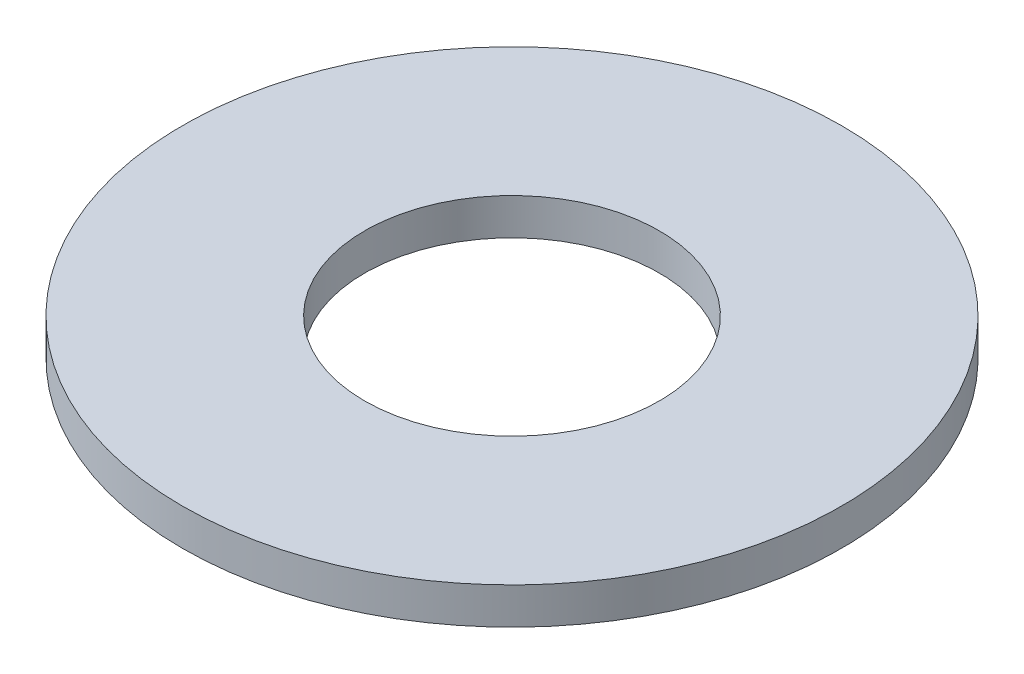
ISO-10303-21;
HEADER;
FILE_DESCRIPTION(('STEP AP214'),'2;1');
FILE_NAME('part.step','',(''),(''),'','','');
FILE_SCHEMA(('AUTOMOTIVE_DESIGN { 1 0 10303 214 1 1 1 1 }'));
ENDSEC;
DATA;
#1=APPLICATION_CONTEXT('core data for automotive mechanical design processes');
#2=APPLICATION_PROTOCOL_DEFINITION('international standard','automotive_design',2000,#1);
#3=PRODUCT_CONTEXT('',#1,'mechanical');
#4=PRODUCT('Part','Part','',(#3));
#5=PRODUCT_RELATED_PRODUCT_CATEGORY('part','',(#4));
#6=PRODUCT_DEFINITION_FORMATION('','',#4);
#7=PRODUCT_DEFINITION_CONTEXT('part definition',#1,'design');
#8=PRODUCT_DEFINITION('design','',#6,#7);
#9=PRODUCT_DEFINITION_SHAPE('','',#8);
#10=(LENGTH_UNIT() NAMED_UNIT(*) SI_UNIT(.MILLI.,.METRE.));
#11=(NAMED_UNIT(*) PLANE_ANGLE_UNIT() SI_UNIT($,.RADIAN.));
#12=(NAMED_UNIT(*) SI_UNIT($,.STERADIAN.) SOLID_ANGLE_UNIT());
#13=UNCERTAINTY_MEASURE_WITH_UNIT(LENGTH_MEASURE(1.E-05),#10,'distance_accuracy_value','');
#14=(GEOMETRIC_REPRESENTATION_CONTEXT(3) GLOBAL_UNCERTAINTY_ASSIGNED_CONTEXT((#13)) GLOBAL_UNIT_ASSIGNED_CONTEXT((#10,
#11,#12)) REPRESENTATION_CONTEXT('',''));
#15=CARTESIAN_POINT('',(0.,0.,0.));
#16=DIRECTION('',(0.,0.,1.));
#17=DIRECTION('',(1.,0.,0.));
#18=AXIS2_PLACEMENT_3D('',#15,#16,#17);
#19=CARTESIAN_POINT('',(0.,1.,0.));
#20=DIRECTION('',(0.,1.,0.));
#21=DIRECTION('',(0.,0.,1.));
#22=AXIS2_PLACEMENT_3D('',#19,#20,#21);
#23=PLANE('',#22);
#24=CARTESIAN_POINT('',(0.,1.,0.));
#25=DIRECTION('',(0.,1.,0.));
#26=DIRECTION('',(0.,0.,1.));
#27=AXIS2_PLACEMENT_3D('',#24,#25,#26);
#28=CIRCLE('',#27,9.);
#29=CARTESIAN_POINT('',(0.,1.,9.));
#30=VERTEX_POINT('',#29);
#31=EDGE_CURVE('E10',#30,#30,#28,.T.);
#32=ORIENTED_EDGE('',*,*,#31,.T.);
#33=EDGE_LOOP('',(#32));
#34=FACE_BOUND('',#33,.T.);
#35=CARTESIAN_POINT('',(0.,1.,0.));
#36=DIRECTION('',(0.,1.,0.));
#37=DIRECTION('',(0.,0.,1.));
#38=AXIS2_PLACEMENT_3D('',#35,#36,#37);
#39=CIRCLE('',#38,4.025);
#40=CARTESIAN_POINT('',(0.,1.,4.025));
#41=VERTEX_POINT('',#40);
#42=EDGE_CURVE('E56',#41,#41,#39,.T.);
#43=ORIENTED_EDGE('',*,*,#42,.F.);
#44=EDGE_LOOP('',(#43));
#45=FACE_BOUND('',#44,.T.);
#46=ADVANCED_FACE('F43',(#34,#45),#23,.T.);
#47=CARTESIAN_POINT('',(0.,0.,0.));
#48=DIRECTION('',(0.,1.,0.));
#49=DIRECTION('',(0.,0.,1.));
#50=AXIS2_PLACEMENT_3D('',#47,#48,#49);
#51=PLANE('',#50);
#52=CARTESIAN_POINT('',(0.,0.,0.));
#53=DIRECTION('',(0.,1.,0.));
#54=DIRECTION('',(0.,0.,1.));
#55=AXIS2_PLACEMENT_3D('',#52,#53,#54);
#56=CIRCLE('',#55,9.);
#57=CARTESIAN_POINT('',(0.,0.,9.));
#58=VERTEX_POINT('',#57);
#59=EDGE_CURVE('E47',#58,#58,#56,.T.);
#60=ORIENTED_EDGE('',*,*,#59,.F.);
#61=EDGE_LOOP('',(#60));
#62=FACE_BOUND('',#61,.T.);
#63=CARTESIAN_POINT('',(0.,0.,0.));
#64=DIRECTION('',(0.,1.,0.));
#65=DIRECTION('',(0.,0.,1.));
#66=AXIS2_PLACEMENT_3D('',#63,#64,#65);
#67=CIRCLE('',#66,4.025);
#68=CARTESIAN_POINT('',(0.,0.,4.025));
#69=VERTEX_POINT('',#68);
#70=EDGE_CURVE('E58',#69,#69,#67,.T.);
#71=ORIENTED_EDGE('',*,*,#70,.T.);
#72=EDGE_LOOP('',(#71));
#73=FACE_BOUND('',#72,.T.);
#74=ADVANCED_FACE('F70',(#62,#73),#51,.F.);
#75=CARTESIAN_POINT('',(0.,1.,0.));
#76=DIRECTION('',(0.,-1.,0.));
#77=DIRECTION('',(0.,0.,-1.));
#78=AXIS2_PLACEMENT_3D('',#75,#76,#77);
#79=CYLINDRICAL_SURFACE('',#78,9.);
#80=ORIENTED_EDGE('',*,*,#31,.F.);
#81=EDGE_LOOP('',(#80));
#82=FACE_BOUND('',#81,.T.);
#83=ORIENTED_EDGE('',*,*,#59,.T.);
#84=EDGE_LOOP('',(#83));
#85=FACE_BOUND('',#84,.T.);
#86=ADVANCED_FACE('F45',(#82,#85),#79,.T.);
#87=CARTESIAN_POINT('',(0.,1.,0.));
#88=DIRECTION('',(0.,-1.,0.));
#89=DIRECTION('',(0.,0.,-1.));
#90=AXIS2_PLACEMENT_3D('',#87,#88,#89);
#91=CYLINDRICAL_SURFACE('',#90,4.025);
#92=ORIENTED_EDGE('',*,*,#42,.T.);
#93=EDGE_LOOP('',(#92));
#94=FACE_BOUND('',#93,.T.);
#95=ORIENTED_EDGE('',*,*,#70,.F.);
#96=EDGE_LOOP('',(#95));
#97=FACE_BOUND('',#96,.T.);
#98=ADVANCED_FACE('F66',(#94,#97),#91,.F.);
#99=CLOSED_SHELL('',(#46,#74,#86,#98));
#100=MANIFOLD_SOLID_BREP('B2',#99);
#101=ADVANCED_BREP_SHAPE_REPRESENTATION('',(#18,#100),#14);
#102=SHAPE_DEFINITION_REPRESENTATION(#9,#101);
ENDSEC;
END-ISO-10303-21;
